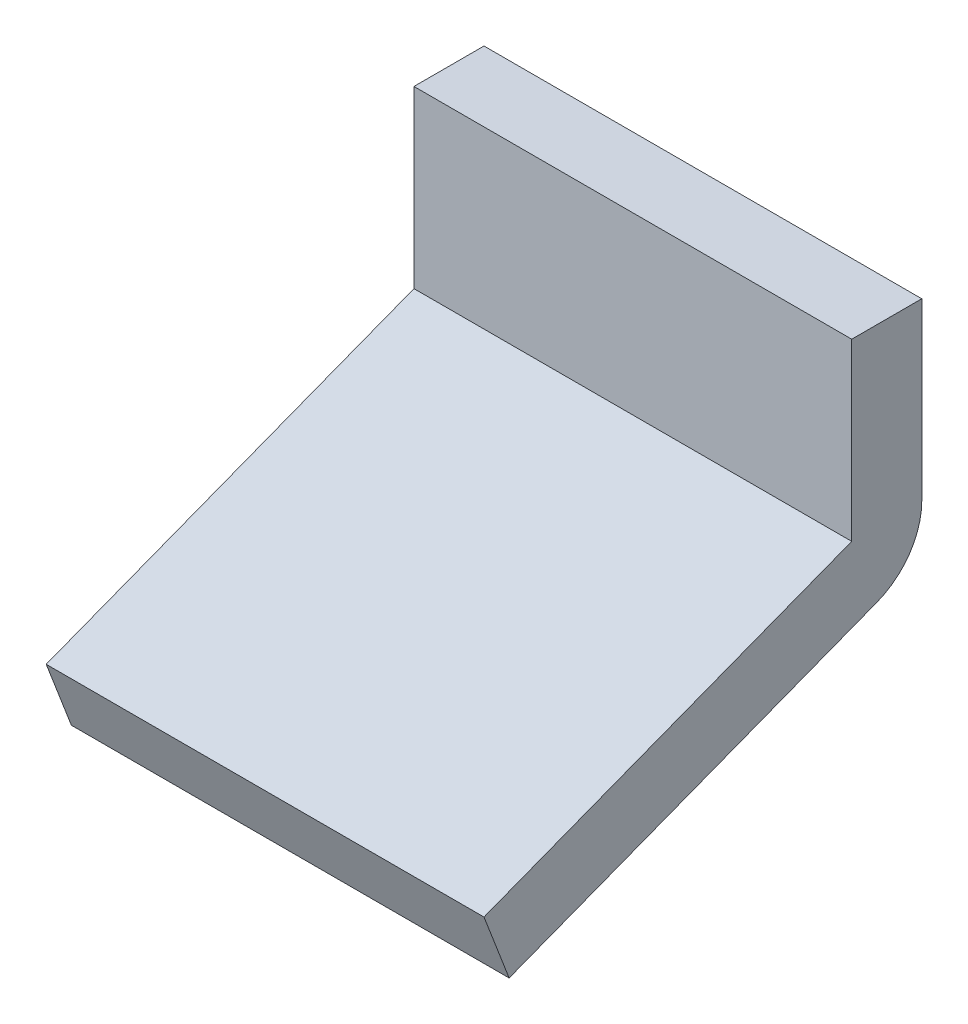
ISO-10303-21;
HEADER;
FILE_DESCRIPTION(('STEP AP214'),'2;1');
FILE_NAME('part.step','',(''),(''),'','','');
FILE_SCHEMA(('AUTOMOTIVE_DESIGN { 1 0 10303 214 1 1 1 1 }'));
ENDSEC;
DATA;
#1=APPLICATION_CONTEXT('core data for automotive mechanical design processes');
#2=APPLICATION_PROTOCOL_DEFINITION('international standard','automotive_design',2000,#1);
#3=PRODUCT_CONTEXT('',#1,'mechanical');
#4=PRODUCT('Part','Part','',(#3));
#5=PRODUCT_RELATED_PRODUCT_CATEGORY('part','',(#4));
#6=PRODUCT_DEFINITION_FORMATION('','',#4);
#7=PRODUCT_DEFINITION_CONTEXT('part definition',#1,'design');
#8=PRODUCT_DEFINITION('design','',#6,#7);
#9=PRODUCT_DEFINITION_SHAPE('','',#8);
#10=(LENGTH_UNIT() NAMED_UNIT(*) SI_UNIT(.MILLI.,.METRE.));
#11=(NAMED_UNIT(*) PLANE_ANGLE_UNIT() SI_UNIT($,.RADIAN.));
#12=(NAMED_UNIT(*) SI_UNIT($,.STERADIAN.) SOLID_ANGLE_UNIT());
#13=UNCERTAINTY_MEASURE_WITH_UNIT(LENGTH_MEASURE(1.E-05),#10,'distance_accuracy_value','');
#14=(GEOMETRIC_REPRESENTATION_CONTEXT(3) GLOBAL_UNCERTAINTY_ASSIGNED_CONTEXT((#13)) GLOBAL_UNIT_ASSIGNED_CONTEXT((#10,
#11,#12)) REPRESENTATION_CONTEXT('',''));
#15=CARTESIAN_POINT('',(0.,0.,0.));
#16=DIRECTION('',(0.,0.,1.));
#17=DIRECTION('',(1.,0.,0.));
#18=AXIS2_PLACEMENT_3D('',#15,#16,#17);
#19=CARTESIAN_POINT('',(1.6,-2.45,0.0800000000000071));
#20=DIRECTION('',(1.,0.,0.));
#21=DIRECTION('',(0.,0.,-1.));
#22=AXIS2_PLACEMENT_3D('',#19,#20,#21);
#23=CYLINDRICAL_SURFACE('',#22,0.0800000000000036);
#24=CARTESIAN_POINT('',(-1.6,-2.45,0.0800000000000071));
#25=DIRECTION('',(1.,0.,0.));
#26=DIRECTION('',(0.,0.,-1.));
#27=AXIS2_PLACEMENT_3D('',#24,#25,#26);
#28=CIRCLE('',#27,0.0800000000000036);
#29=CARTESIAN_POINT('',(-1.6,-2.52466666666667,0.051279121028623));
#30=VERTEX_POINT('',#29);
#31=CARTESIAN_POINT('',(-1.6,-2.45,0.));
#32=VERTEX_POINT('',#31);
#33=EDGE_CURVE('E138',#30,#32,#28,.T.);
#34=ORIENTED_EDGE('',*,*,#33,.T.);
#35=DIRECTION('',(-1.,0.,0.));
#36=VECTOR('',#35,1.);
#37=CARTESIAN_POINT('',(-1.6,-2.45,0.));
#38=LINE('',#37,#36);
#39=CARTESIAN_POINT('',(-1.1,-2.45,0.));
#40=VERTEX_POINT('',#39);
#41=EDGE_CURVE('E72',#40,#32,#38,.T.);
#42=ORIENTED_EDGE('',*,*,#41,.F.);
#43=CARTESIAN_POINT('',(-1.1,-2.45,0.0800000000000071));
#44=DIRECTION('',(1.,0.,0.));
#45=DIRECTION('',(0.,0.,-1.));
#46=AXIS2_PLACEMENT_3D('',#43,#44,#45);
#47=CIRCLE('',#46,0.0800000000000036);
#48=CARTESIAN_POINT('',(-1.1,-2.52466666666667,0.051279121028623));
#49=VERTEX_POINT('',#48);
#50=EDGE_CURVE('E19',#40,#49,#47,.F.);
#51=ORIENTED_EDGE('',*,*,#50,.T.);
#52=DIRECTION('',(1.,0.,0.));
#53=VECTOR('',#52,1.);
#54=CARTESIAN_POINT('',(1.6,-2.52466666666667,0.0512791210286232));
#55=LINE('',#54,#53);
#56=EDGE_CURVE('E76',#30,#49,#55,.T.);
#57=ORIENTED_EDGE('',*,*,#56,.F.);
#58=EDGE_LOOP('',(#34,#42,#51,#57));
#59=FACE_BOUND('',#58,.T.);
#60=ADVANCED_FACE('F16',(#59),#23,.T.);
#61=CARTESIAN_POINT('',(-1.6,-2.25,0.));
#62=DIRECTION('',(0.,0.,-1.));
#63=DIRECTION('',(-1.,0.,0.));
#64=AXIS2_PLACEMENT_3D('',#61,#62,#63);
#65=PLANE('',#64);
#66=DIRECTION('',(0.,1.,0.));
#67=VECTOR('',#66,1.);
#68=CARTESIAN_POINT('',(-1.6,-2.45,0.));
#69=LINE('',#68,#67);
#70=CARTESIAN_POINT('',(-1.6,-2.25,0.));
#71=VERTEX_POINT('',#70);
#72=EDGE_CURVE('E116',#32,#71,#69,.T.);
#73=ORIENTED_EDGE('',*,*,#72,.T.);
#74=DIRECTION('',(1.,0.,0.));
#75=VECTOR('',#74,1.);
#76=CARTESIAN_POINT('',(-1.6,-2.25,0.));
#77=LINE('',#76,#75);
#78=CARTESIAN_POINT('',(-1.1,-2.25,0.));
#79=VERTEX_POINT('',#78);
#80=EDGE_CURVE('E90',#71,#79,#77,.T.);
#81=ORIENTED_EDGE('',*,*,#80,.T.);
#82=DIRECTION('',(0.,1.,0.));
#83=VECTOR('',#82,1.);
#84=CARTESIAN_POINT('',(-1.1,-2.4062216108807,0.));
#85=LINE('',#84,#83);
#86=EDGE_CURVE('E82',#79,#40,#85,.F.);
#87=ORIENTED_EDGE('',*,*,#86,.T.);
#88=ORIENTED_EDGE('',*,*,#41,.T.);
#89=EDGE_LOOP('',(#73,#81,#87,#88));
#90=FACE_BOUND('',#89,.T.);
#91=ADVANCED_FACE('F166',(#90),#65,.T.);
#92=CARTESIAN_POINT('',(-1.6,-2.25,0.));
#93=DIRECTION('',(0.,-1.,0.));
#94=DIRECTION('',(0.,0.,-1.));
#95=AXIS2_PLACEMENT_3D('',#92,#93,#94);
#96=PLANE('',#95);
#97=DIRECTION('',(0.,0.,1.));
#98=VECTOR('',#97,1.);
#99=CARTESIAN_POINT('',(-1.1,-2.25,0.578982417171311));
#100=LINE('',#99,#98);
#101=CARTESIAN_POINT('',(-1.1,-2.25,0.080000000000007));
#102=VERTEX_POINT('',#101);
#103=EDGE_CURVE('E89',#102,#79,#100,.F.);
#104=ORIENTED_EDGE('',*,*,#103,.T.);
#105=ORIENTED_EDGE('',*,*,#80,.F.);
#106=DIRECTION('',(0.,0.,-1.));
#107=VECTOR('',#106,1.);
#108=CARTESIAN_POINT('',(-1.6,-2.25,0.));
#109=LINE('',#108,#107);
#110=CARTESIAN_POINT('',(-1.6,-2.25,0.0800000000000071));
#111=VERTEX_POINT('',#110);
#112=EDGE_CURVE('E113',#71,#111,#109,.F.);
#113=ORIENTED_EDGE('',*,*,#112,.T.);
#114=DIRECTION('',(-1.,0.,0.));
#115=VECTOR('',#114,1.);
#116=CARTESIAN_POINT('',(-1.6,-2.25,0.0800000000000071));
#117=LINE('',#116,#115);
#118=EDGE_CURVE('E96',#111,#102,#117,.F.);
#119=ORIENTED_EDGE('',*,*,#118,.T.);
#120=EDGE_LOOP('',(#104,#105,#113,#119));
#121=FACE_BOUND('',#120,.T.);
#122=ADVANCED_FACE('F163',(#121),#96,.F.);
#123=CARTESIAN_POINT('',(1.6,-2.6862216108807,0.471279121028623));
#124=DIRECTION('',(0.,-0.933333333333336,-0.359010987142294));
#125=DIRECTION('',(0.,0.359010987142294,-0.933333333333336));
#126=AXIS2_PLACEMENT_3D('',#123,#124,#125);
#127=PLANE('',#126);
#128=DIRECTION('',(0.,0.35901098714229,-0.933333333333337));
#129=VECTOR('',#128,1.);
#130=CARTESIAN_POINT('',(-1.6,-2.6862216108807,0.471279121028623));
#131=LINE('',#130,#129);
#132=CARTESIAN_POINT('',(-1.6,-2.6862216108807,0.471279121028623));
#133=VERTEX_POINT('',#132);
#134=EDGE_CURVE('E87',#133,#30,#131,.T.);
#135=ORIENTED_EDGE('',*,*,#134,.T.);
#136=ORIENTED_EDGE('',*,*,#56,.T.);
#137=DIRECTION('',(0.,-0.35901098714229,0.933333333333337));
#138=VECTOR('',#137,1.);
#139=CARTESIAN_POINT('',(-1.1,-2.52466666666667,0.0512791210286223));
#140=LINE('',#139,#138);
#141=CARTESIAN_POINT('',(-1.1,-2.6862216108807,0.471279121028622));
#142=VERTEX_POINT('',#141);
#143=EDGE_CURVE('E81',#49,#142,#140,.T.);
#144=ORIENTED_EDGE('',*,*,#143,.T.);
#145=DIRECTION('',(1.,0.,0.));
#146=VECTOR('',#145,1.);
#147=CARTESIAN_POINT('',(1.6,-2.6862216108807,0.471279121028622));
#148=LINE('',#147,#146);
#149=EDGE_CURVE('E119',#133,#142,#148,.T.);
#150=ORIENTED_EDGE('',*,*,#149,.F.);
#151=EDGE_LOOP('',(#135,#136,#144,#150));
#152=FACE_BOUND('',#151,.T.);
#153=ADVANCED_FACE('F84',(#152),#127,.T.);
#154=CARTESIAN_POINT('',(-1.1,-2.4062216108807,0.578982417171311));
#155=DIRECTION('',(-1.,0.,0.));
#156=DIRECTION('',(0.,0.,1.));
#157=AXIS2_PLACEMENT_3D('',#154,#155,#156);
#158=PLANE('',#157);
#159=DIRECTION('',(0.,-0.933333333333333,-0.359010987142301));
#160=VECTOR('',#159,1.);
#161=CARTESIAN_POINT('',(-1.1,-2.61155494421403,0.500000000000007));
#162=LINE('',#161,#160);
#163=CARTESIAN_POINT('',(-1.1,-2.61155494421403,0.500000000000007));
#164=VERTEX_POINT('',#163);
#165=EDGE_CURVE('E94',#142,#164,#162,.F.);
#166=ORIENTED_EDGE('',*,*,#165,.F.);
#167=ORIENTED_EDGE('',*,*,#143,.F.);
#168=ORIENTED_EDGE('',*,*,#50,.F.);
#169=ORIENTED_EDGE('',*,*,#86,.F.);
#170=ORIENTED_EDGE('',*,*,#103,.F.);
#171=DIRECTION('',(0.,1.,0.));
#172=VECTOR('',#171,1.);
#173=CARTESIAN_POINT('',(-1.1,-2.25,0.0800000000000071));
#174=LINE('',#173,#172);
#175=CARTESIAN_POINT('',(-1.1,-2.45,0.080000000000007));
#176=VERTEX_POINT('',#175);
#177=EDGE_CURVE('E98',#102,#176,#174,.F.);
#178=ORIENTED_EDGE('',*,*,#177,.T.);
#179=DIRECTION('',(0.,-0.359010987142301,0.933333333333333));
#180=VECTOR('',#179,1.);
#181=CARTESIAN_POINT('',(-1.1,-2.45,0.0800000000000071));
#182=LINE('',#181,#180);
#183=EDGE_CURVE('E121',#164,#176,#182,.F.);
#184=ORIENTED_EDGE('',*,*,#183,.F.);
#185=EDGE_LOOP('',(#166,#167,#168,#169,#170,#178,#184));
#186=FACE_BOUND('',#185,.T.);
#187=ADVANCED_FACE('F92',(#186),#158,.F.);
#188=CARTESIAN_POINT('',(-1.6,-2.25,0.0800000000000071));
#189=DIRECTION('',(0.,0.,-1.));
#190=DIRECTION('',(-1.,0.,0.));
#191=AXIS2_PLACEMENT_3D('',#188,#189,#190);
#192=PLANE('',#191);
#193=ORIENTED_EDGE('',*,*,#177,.F.);
#194=ORIENTED_EDGE('',*,*,#118,.F.);
#195=DIRECTION('',(0.,1.,0.));
#196=VECTOR('',#195,1.);
#197=CARTESIAN_POINT('',(-1.6,-2.45,0.0800000000000071));
#198=LINE('',#197,#196);
#199=CARTESIAN_POINT('',(-1.6,-2.45,0.0800000000000071));
#200=VERTEX_POINT('',#199);
#201=EDGE_CURVE('E115',#111,#200,#198,.F.);
#202=ORIENTED_EDGE('',*,*,#201,.T.);
#203=DIRECTION('',(1.,0.,0.));
#204=VECTOR('',#203,1.);
#205=CARTESIAN_POINT('',(1.6,-2.45,0.0800000000000071));
#206=LINE('',#205,#204);
#207=EDGE_CURVE('E146',#176,#200,#206,.F.);
#208=ORIENTED_EDGE('',*,*,#207,.F.);
#209=EDGE_LOOP('',(#193,#194,#202,#208));
#210=FACE_BOUND('',#209,.T.);
#211=ADVANCED_FACE('F160',(#210),#192,.F.);
#212=CARTESIAN_POINT('',(-1.6,-2.45,0.));
#213=DIRECTION('',(1.,0.,0.));
#214=DIRECTION('',(0.,0.,-1.));
#215=AXIS2_PLACEMENT_3D('',#212,#213,#214);
#216=PLANE('',#215);
#217=ORIENTED_EDGE('',*,*,#112,.F.);
#218=ORIENTED_EDGE('',*,*,#72,.F.);
#219=ORIENTED_EDGE('',*,*,#33,.F.);
#220=ORIENTED_EDGE('',*,*,#134,.F.);
#221=DIRECTION('',(0.,-0.933333333333333,-0.359010987142301));
#222=VECTOR('',#221,1.);
#223=CARTESIAN_POINT('',(-1.6,-2.61155494421403,0.500000000000007));
#224=LINE('',#223,#222);
#225=CARTESIAN_POINT('',(-1.6,-2.61155494421403,0.500000000000007));
#226=VERTEX_POINT('',#225);
#227=EDGE_CURVE('E34',#226,#133,#224,.T.);
#228=ORIENTED_EDGE('',*,*,#227,.F.);
#229=DIRECTION('',(0.,-0.359010987142301,0.933333333333333));
#230=VECTOR('',#229,1.);
#231=CARTESIAN_POINT('',(-1.6,-2.45,0.0800000000000071));
#232=LINE('',#231,#230);
#233=EDGE_CURVE('E25',#200,#226,#232,.T.);
#234=ORIENTED_EDGE('',*,*,#233,.F.);
#235=ORIENTED_EDGE('',*,*,#201,.F.);
#236=EDGE_LOOP('',(#217,#218,#219,#220,#228,#234,#235));
#237=FACE_BOUND('',#236,.T.);
#238=ADVANCED_FACE('F155',(#237),#216,.F.);
#239=CARTESIAN_POINT('',(1.6,-2.61155494421403,0.500000000000007));
#240=DIRECTION('',(0.,-0.359010987142301,0.933333333333333));
#241=DIRECTION('',(0.,-0.933333333333333,-0.359010987142301));
#242=AXIS2_PLACEMENT_3D('',#239,#240,#241);
#243=PLANE('',#242);
#244=ORIENTED_EDGE('',*,*,#227,.T.);
#245=ORIENTED_EDGE('',*,*,#149,.T.);
#246=ORIENTED_EDGE('',*,*,#165,.T.);
#247=DIRECTION('',(1.,0.,0.));
#248=VECTOR('',#247,1.);
#249=CARTESIAN_POINT('',(1.6,-2.61155494421403,0.500000000000005));
#250=LINE('',#249,#248);
#251=EDGE_CURVE('E11',#226,#164,#250,.T.);
#252=ORIENTED_EDGE('',*,*,#251,.F.);
#253=EDGE_LOOP('',(#244,#245,#246,#252));
#254=FACE_BOUND('',#253,.T.);
#255=ADVANCED_FACE('F168',(#254),#243,.T.);
#256=CARTESIAN_POINT('',(1.6,-2.45,0.0800000000000071));
#257=DIRECTION('',(0.,0.933333333333333,0.359010987142301));
#258=DIRECTION('',(0.,-0.359010987142301,0.933333333333333));
#259=AXIS2_PLACEMENT_3D('',#256,#257,#258);
#260=PLANE('',#259);
#261=ORIENTED_EDGE('',*,*,#233,.T.);
#262=ORIENTED_EDGE('',*,*,#251,.T.);
#263=ORIENTED_EDGE('',*,*,#183,.T.);
#264=ORIENTED_EDGE('',*,*,#207,.T.);
#265=EDGE_LOOP('',(#261,#262,#263,#264));
#266=FACE_BOUND('',#265,.T.);
#267=ADVANCED_FACE('F151',(#266),#260,.T.);
#268=CLOSED_SHELL('',(#60,#91,#122,#153,#187,#211,#238,#255,#267));
#269=MANIFOLD_SOLID_BREP('B1',#268);
#270=ADVANCED_BREP_SHAPE_REPRESENTATION('',(#18,#269),#14);
#271=SHAPE_DEFINITION_REPRESENTATION(#9,#270);
ENDSEC;
END-ISO-10303-21;
